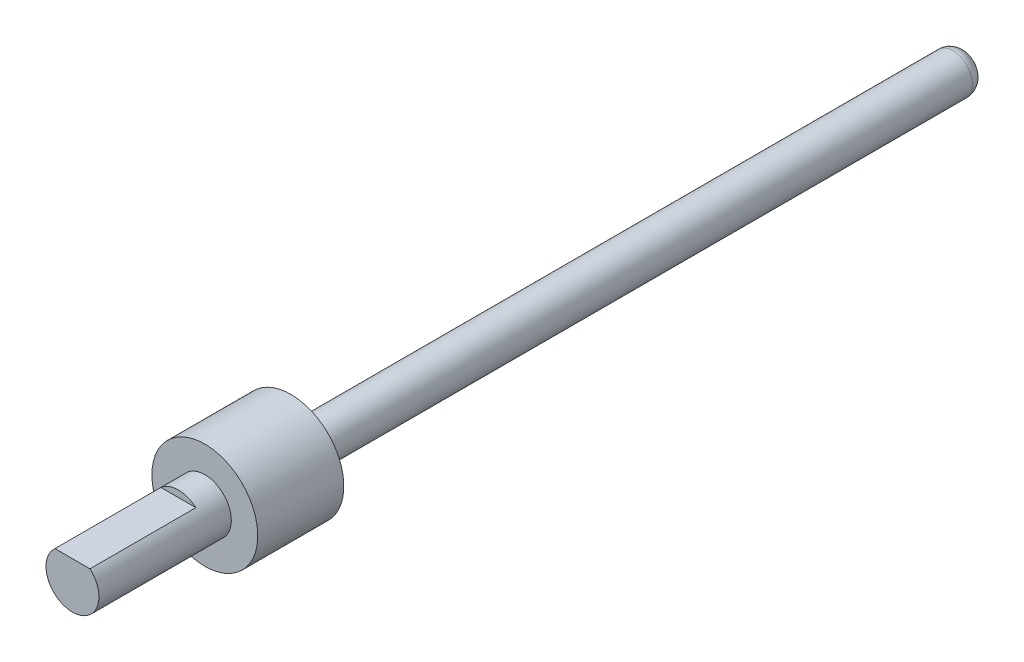
ISO-10303-21;
HEADER;
FILE_DESCRIPTION(('STEP AP214'),'2;1');
FILE_NAME('part.step','',(''),(''),'','','');
FILE_SCHEMA(('AUTOMOTIVE_DESIGN { 1 0 10303 214 1 1 1 1 }'));
ENDSEC;
DATA;
#1=APPLICATION_CONTEXT('core data for automotive mechanical design processes');
#2=APPLICATION_PROTOCOL_DEFINITION('international standard','automotive_design',2000,#1);
#3=PRODUCT_CONTEXT('',#1,'mechanical');
#4=PRODUCT('Part','Part','',(#3));
#5=PRODUCT_RELATED_PRODUCT_CATEGORY('part','',(#4));
#6=PRODUCT_DEFINITION_FORMATION('','',#4);
#7=PRODUCT_DEFINITION_CONTEXT('part definition',#1,'design');
#8=PRODUCT_DEFINITION('design','',#6,#7);
#9=PRODUCT_DEFINITION_SHAPE('','',#8);
#10=(LENGTH_UNIT() NAMED_UNIT(*) SI_UNIT(.MILLI.,.METRE.));
#11=(NAMED_UNIT(*) PLANE_ANGLE_UNIT() SI_UNIT($,.RADIAN.));
#12=(NAMED_UNIT(*) SI_UNIT($,.STERADIAN.) SOLID_ANGLE_UNIT());
#13=UNCERTAINTY_MEASURE_WITH_UNIT(LENGTH_MEASURE(1.E-05),#10,'distance_accuracy_value','');
#14=(GEOMETRIC_REPRESENTATION_CONTEXT(3) GLOBAL_UNCERTAINTY_ASSIGNED_CONTEXT((#13)) GLOBAL_UNIT_ASSIGNED_CONTEXT((#10,
#11,#12)) REPRESENTATION_CONTEXT('',''));
#15=CARTESIAN_POINT('',(0.,0.,0.));
#16=DIRECTION('',(0.,0.,1.));
#17=DIRECTION('',(1.,0.,0.));
#18=AXIS2_PLACEMENT_3D('',#15,#16,#17);
#19=CARTESIAN_POINT('',(0.,0.,-16.5));
#20=DIRECTION('',(0.,0.,-1.));
#21=DIRECTION('',(-1.,0.,0.));
#22=AXIS2_PLACEMENT_3D('',#19,#20,#21);
#23=PLANE('',#22);
#24=CARTESIAN_POINT('',(0.,0.,-16.5));
#25=DIRECTION('',(0.,0.,-1.));
#26=DIRECTION('',(-1.,0.,0.));
#27=AXIS2_PLACEMENT_3D('',#24,#25,#26);
#28=CIRCLE('',#27,4.);
#29=CARTESIAN_POINT('',(-4.,0.,-16.5));
#30=VERTEX_POINT('',#29);
#31=EDGE_CURVE('E82',#30,#30,#28,.T.);
#32=ORIENTED_EDGE('',*,*,#31,.T.);
#33=EDGE_LOOP('',(#32));
#34=FACE_BOUND('',#33,.T.);
#35=CARTESIAN_POINT('',(0.,0.,-16.5));
#36=DIRECTION('',(0.,0.,-1.));
#37=DIRECTION('',(-1.,0.,0.));
#38=AXIS2_PLACEMENT_3D('',#35,#36,#37);
#39=CIRCLE('',#38,1.5);
#40=CARTESIAN_POINT('',(-1.5,0.,-16.5));
#41=VERTEX_POINT('',#40);
#42=EDGE_CURVE('E86',#41,#41,#39,.T.);
#43=ORIENTED_EDGE('',*,*,#42,.F.);
#44=EDGE_LOOP('',(#43));
#45=FACE_BOUND('',#44,.T.);
#46=ADVANCED_FACE('F32',(#34,#45),#23,.T.);
#47=CARTESIAN_POINT('',(0.,0.,-10.));
#48=DIRECTION('',(0.,0.,1.));
#49=DIRECTION('',(1.,0.,0.));
#50=AXIS2_PLACEMENT_3D('',#47,#48,#49);
#51=CYLINDRICAL_SURFACE('',#50,2.);
#52=DIRECTION('',(0.,0.,1.));
#53=VECTOR('',#52,1.);
#54=CARTESIAN_POINT('',(1.3228756555323,1.5,-8.));
#55=LINE('',#54,#53);
#56=CARTESIAN_POINT('',(1.3228756555323,1.5,-8.));
#57=VERTEX_POINT('',#56);
#58=CARTESIAN_POINT('',(1.3228756555323,1.5,0.));
#59=VERTEX_POINT('',#58);
#60=EDGE_CURVE('E53',#57,#59,#55,.T.);
#61=ORIENTED_EDGE('',*,*,#60,.T.);
#62=CARTESIAN_POINT('',(0.,0.,0.));
#63=DIRECTION('',(0.,0.,1.));
#64=DIRECTION('',(1.,0.,0.));
#65=AXIS2_PLACEMENT_3D('',#62,#63,#64);
#66=CIRCLE('',#65,2.);
#67=CARTESIAN_POINT('',(-1.3228756555323,1.5,0.));
#68=VERTEX_POINT('',#67);
#69=EDGE_CURVE('E70',#68,#59,#66,.T.);
#70=ORIENTED_EDGE('',*,*,#69,.F.);
#71=DIRECTION('',(0.,0.,1.));
#72=VECTOR('',#71,1.);
#73=CARTESIAN_POINT('',(-1.3228756555323,1.5,-8.));
#74=LINE('',#73,#72);
#75=CARTESIAN_POINT('',(-1.3228756555323,1.5,-8.));
#76=VERTEX_POINT('',#75);
#77=EDGE_CURVE('E47',#76,#68,#74,.T.);
#78=ORIENTED_EDGE('',*,*,#77,.F.);
#79=CARTESIAN_POINT('',(0.,0.,-8.));
#80=DIRECTION('',(0.,0.,1.));
#81=DIRECTION('',(1.,0.,0.));
#82=AXIS2_PLACEMENT_3D('',#79,#80,#81);
#83=CIRCLE('',#82,2.);
#84=EDGE_CURVE('E63',#57,#76,#83,.T.);
#85=ORIENTED_EDGE('',*,*,#84,.F.);
#86=EDGE_LOOP('',(#61,#70,#78,#85));
#87=FACE_BOUND('',#86,.T.);
#88=CARTESIAN_POINT('',(0.,0.,-10.));
#89=DIRECTION('',(0.,0.,-1.));
#90=DIRECTION('',(-1.,0.,0.));
#91=AXIS2_PLACEMENT_3D('',#88,#89,#90);
#92=CIRCLE('',#91,2.);
#93=CARTESIAN_POINT('',(-2.,0.,-10.));
#94=VERTEX_POINT('',#93);
#95=EDGE_CURVE('E64',#94,#94,#92,.F.);
#96=ORIENTED_EDGE('',*,*,#95,.T.);
#97=EDGE_LOOP('',(#96));
#98=FACE_BOUND('',#97,.T.);
#99=ADVANCED_FACE('F68',(#87,#98),#51,.T.);
#100=CARTESIAN_POINT('',(0.,0.,0.));
#101=DIRECTION('',(0.,0.,1.));
#102=DIRECTION('',(1.,0.,0.));
#103=AXIS2_PLACEMENT_3D('',#100,#101,#102);
#104=PLANE('',#103);
#105=DIRECTION('',(1.,0.,0.));
#106=VECTOR('',#105,1.);
#107=CARTESIAN_POINT('',(-1.3228756555323,1.5,0.));
#108=LINE('',#107,#106);
#109=EDGE_CURVE('E58',#68,#59,#108,.T.);
#110=ORIENTED_EDGE('',*,*,#109,.F.);
#111=ORIENTED_EDGE('',*,*,#69,.T.);
#112=EDGE_LOOP('',(#110,#111));
#113=FACE_BOUND('',#112,.T.);
#114=ADVANCED_FACE('F72',(#113),#104,.T.);
#115=CARTESIAN_POINT('',(-1.3228756555323,1.5,-8.));
#116=DIRECTION('',(0.,-1.,0.));
#117=DIRECTION('',(0.,0.,-1.));
#118=AXIS2_PLACEMENT_3D('',#115,#116,#117);
#119=PLANE('',#118);
#120=ORIENTED_EDGE('',*,*,#109,.T.);
#121=ORIENTED_EDGE('',*,*,#60,.F.);
#122=DIRECTION('',(1.,0.,0.));
#123=VECTOR('',#122,1.);
#124=CARTESIAN_POINT('',(-1.3228756555323,1.5,-8.));
#125=LINE('',#124,#123);
#126=EDGE_CURVE('E76',#76,#57,#125,.T.);
#127=ORIENTED_EDGE('',*,*,#126,.F.);
#128=ORIENTED_EDGE('',*,*,#77,.T.);
#129=EDGE_LOOP('',(#120,#121,#127,#128));
#130=FACE_BOUND('',#129,.T.);
#131=ADVANCED_FACE('F59',(#130),#119,.F.);
#132=CARTESIAN_POINT('',(0.,0.,-8.));
#133=DIRECTION('',(0.,0.,1.));
#134=DIRECTION('',(1.,0.,0.));
#135=AXIS2_PLACEMENT_3D('',#132,#133,#134);
#136=PLANE('',#135);
#137=ORIENTED_EDGE('',*,*,#84,.T.);
#138=ORIENTED_EDGE('',*,*,#126,.T.);
#139=EDGE_LOOP('',(#137,#138));
#140=FACE_BOUND('',#139,.T.);
#141=ADVANCED_FACE('F110',(#140),#136,.T.);
#142=CARTESIAN_POINT('',(0.,0.,-16.5));
#143=DIRECTION('',(0.,0.,1.));
#144=DIRECTION('',(1.,0.,0.));
#145=AXIS2_PLACEMENT_3D('',#142,#143,#144);
#146=CYLINDRICAL_SURFACE('',#145,4.);
#147=ORIENTED_EDGE('',*,*,#31,.F.);
#148=EDGE_LOOP('',(#147));
#149=FACE_BOUND('',#148,.T.);
#150=CARTESIAN_POINT('',(0.,0.,-10.));
#151=DIRECTION('',(0.,0.,-1.));
#152=DIRECTION('',(-1.,0.,0.));
#153=AXIS2_PLACEMENT_3D('',#150,#151,#152);
#154=CIRCLE('',#153,4.);
#155=CARTESIAN_POINT('',(-4.,0.,-10.));
#156=VERTEX_POINT('',#155);
#157=EDGE_CURVE('E83',#156,#156,#154,.T.);
#158=ORIENTED_EDGE('',*,*,#157,.T.);
#159=EDGE_LOOP('',(#158));
#160=FACE_BOUND('',#159,.T.);
#161=ADVANCED_FACE('F106',(#149,#160),#146,.T.);
#162=CARTESIAN_POINT('',(0.,0.,-10.));
#163=DIRECTION('',(0.,0.,-1.));
#164=DIRECTION('',(-1.,0.,0.));
#165=AXIS2_PLACEMENT_3D('',#162,#163,#164);
#166=PLANE('',#165);
#167=ORIENTED_EDGE('',*,*,#95,.F.);
#168=EDGE_LOOP('',(#167));
#169=FACE_BOUND('',#168,.T.);
#170=ORIENTED_EDGE('',*,*,#157,.F.);
#171=EDGE_LOOP('',(#170));
#172=FACE_BOUND('',#171,.T.);
#173=ADVANCED_FACE('F103',(#169,#172),#166,.F.);
#174=CARTESIAN_POINT('',(0.,0.,-67.5));
#175=DIRECTION('',(0.,0.,1.));
#176=DIRECTION('',(1.,0.,0.));
#177=AXIS2_PLACEMENT_3D('',#174,#175,#176);
#178=CYLINDRICAL_SURFACE('',#177,1.5);
#179=CARTESIAN_POINT('',(0.,0.,-66.5));
#180=DIRECTION('',(0.,0.,-1.));
#181=DIRECTION('',(-1.,0.,0.));
#182=AXIS2_PLACEMENT_3D('',#179,#180,#181);
#183=CIRCLE('',#182,1.5);
#184=CARTESIAN_POINT('',(-1.5,0.,-66.5));
#185=VERTEX_POINT('',#184);
#186=EDGE_CURVE('E11',#185,#185,#183,.F.);
#187=ORIENTED_EDGE('',*,*,#186,.T.);
#188=EDGE_LOOP('',(#187));
#189=FACE_BOUND('',#188,.T.);
#190=ORIENTED_EDGE('',*,*,#42,.T.);
#191=EDGE_LOOP('',(#190));
#192=FACE_BOUND('',#191,.T.);
#193=ADVANCED_FACE('F92',(#189,#192),#178,.T.);
#194=CARTESIAN_POINT('',(0.,0.,-67.5));
#195=DIRECTION('',(0.,0.,-1.));
#196=DIRECTION('',(-1.,0.,0.));
#197=AXIS2_PLACEMENT_3D('',#194,#195,#196);
#198=PLANE('',#197);
#199=CARTESIAN_POINT('',(0.,0.,-67.5));
#200=DIRECTION('',(0.,0.,-1.));
#201=DIRECTION('',(-1.,0.,0.));
#202=AXIS2_PLACEMENT_3D('',#199,#200,#201);
#203=CIRCLE('',#202,0.5);
#204=CARTESIAN_POINT('',(-0.5,0.,-67.5));
#205=VERTEX_POINT('',#204);
#206=EDGE_CURVE('E40',#205,#205,#203,.T.);
#207=ORIENTED_EDGE('',*,*,#206,.T.);
#208=EDGE_LOOP('',(#207));
#209=FACE_BOUND('',#208,.T.);
#210=ADVANCED_FACE('F144',(#209),#198,.T.);
#211=CARTESIAN_POINT('',(0.,0.,-66.5));
#212=DIRECTION('',(0.,0.,-1.));
#213=DIRECTION('',(-1.,0.,0.));
#214=AXIS2_PLACEMENT_3D('',#211,#212,#213);
#215=DEGENERATE_TOROIDAL_SURFACE('',#214,0.5,1.,.T.);
#216=ORIENTED_EDGE('',*,*,#186,.F.);
#217=EDGE_LOOP('',(#216));
#218=FACE_BOUND('',#217,.T.);
#219=ORIENTED_EDGE('',*,*,#206,.F.);
#220=EDGE_LOOP('',(#219));
#221=FACE_BOUND('',#220,.T.);
#222=ADVANCED_FACE('F34',(#218,#221),#215,.T.);
#223=CLOSED_SHELL('',(#46,#99,#114,#131,#141,#161,#173,#193,#210,#222));
#224=MANIFOLD_SOLID_BREP('B2',#223);
#225=ADVANCED_BREP_SHAPE_REPRESENTATION('',(#18,#224),#14);
#226=SHAPE_DEFINITION_REPRESENTATION(#9,#225);
ENDSEC;
END-ISO-10303-21;
